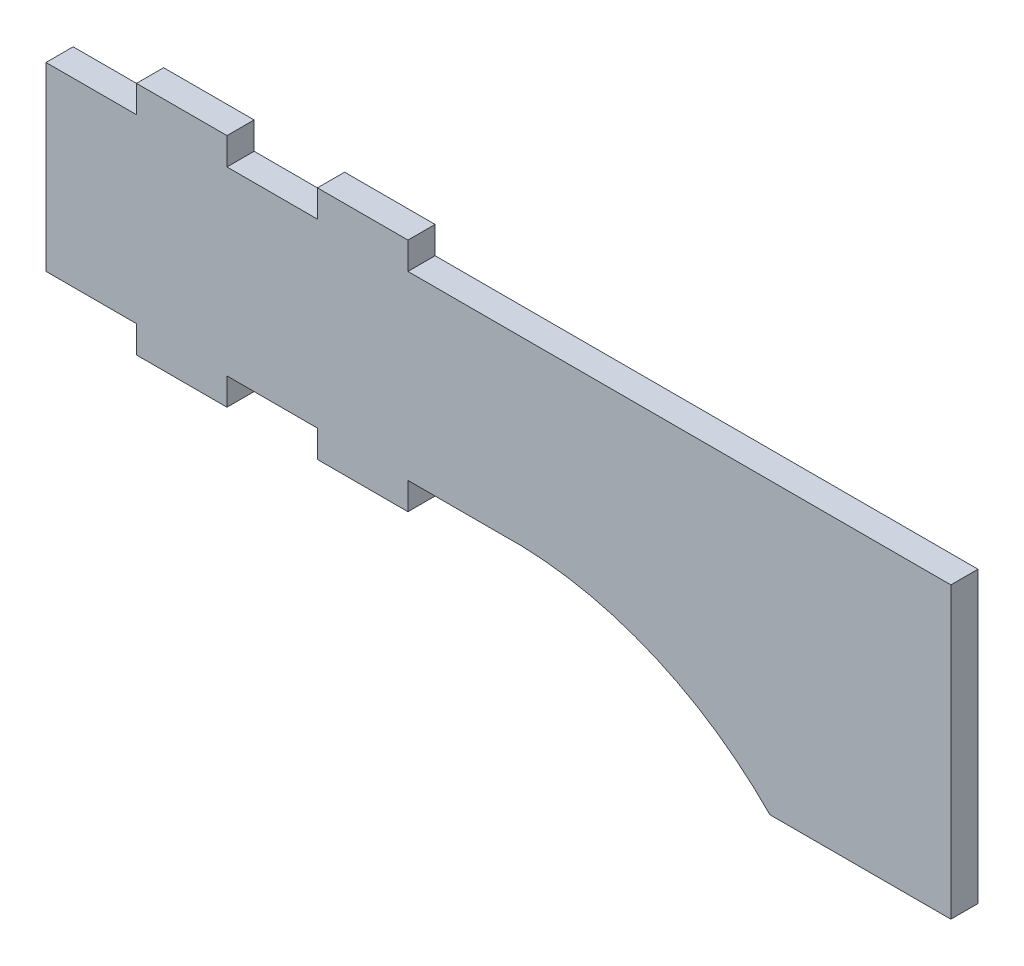
ISO-10303-21;
HEADER;
FILE_DESCRIPTION(('STEP AP214'),'2;1');
FILE_NAME('part.step','',(''),(''),'','','');
FILE_SCHEMA(('AUTOMOTIVE_DESIGN { 1 0 10303 214 1 1 1 1 }'));
ENDSEC;
DATA;
#1=APPLICATION_CONTEXT('core data for automotive mechanical design processes');
#2=APPLICATION_PROTOCOL_DEFINITION('international standard','automotive_design',2000,#1);
#3=PRODUCT_CONTEXT('',#1,'mechanical');
#4=PRODUCT('Part','Part','',(#3));
#5=PRODUCT_RELATED_PRODUCT_CATEGORY('part','',(#4));
#6=PRODUCT_DEFINITION_FORMATION('','',#4);
#7=PRODUCT_DEFINITION_CONTEXT('part definition',#1,'design');
#8=PRODUCT_DEFINITION('design','',#6,#7);
#9=PRODUCT_DEFINITION_SHAPE('','',#8);
#10=(LENGTH_UNIT() NAMED_UNIT(*) SI_UNIT(.MILLI.,.METRE.));
#11=(NAMED_UNIT(*) PLANE_ANGLE_UNIT() SI_UNIT($,.RADIAN.));
#12=(NAMED_UNIT(*) SI_UNIT($,.STERADIAN.) SOLID_ANGLE_UNIT());
#13=UNCERTAINTY_MEASURE_WITH_UNIT(LENGTH_MEASURE(1.E-05),#10,'distance_accuracy_value','');
#14=(GEOMETRIC_REPRESENTATION_CONTEXT(3) GLOBAL_UNCERTAINTY_ASSIGNED_CONTEXT((#13)) GLOBAL_UNIT_ASSIGNED_CONTEXT((#10,
#11,#12)) REPRESENTATION_CONTEXT('',''));
#15=CARTESIAN_POINT('',(0.,0.,0.));
#16=DIRECTION('',(0.,0.,1.));
#17=DIRECTION('',(1.,0.,0.));
#18=AXIS2_PLACEMENT_3D('',#15,#16,#17);
#19=CARTESIAN_POINT('',(-27.5171568507019,-1.37040119863,1.5));
#20=DIRECTION('',(0.,1.,0.));
#21=DIRECTION('',(0.,0.,1.));
#22=AXIS2_PLACEMENT_3D('',#19,#20,#21);
#23=PLANE('',#22);
#24=DIRECTION('',(1.,0.,0.));
#25=VECTOR('',#24,1.);
#26=CARTESIAN_POINT('',(-27.5171568507019,-1.37040119863,0.));
#27=LINE('',#26,#25);
#28=CARTESIAN_POINT('',(-27.5171568507019,-1.37040119863,0.));
#29=VERTEX_POINT('',#28);
#30=CARTESIAN_POINT('',(-22.5171568507019,-1.37040119863,0.));
#31=VERTEX_POINT('',#30);
#32=EDGE_CURVE('E224',#29,#31,#27,.T.);
#33=ORIENTED_EDGE('',*,*,#32,.T.);
#34=DIRECTION('',(0.,0.,-1.));
#35=VECTOR('',#34,1.);
#36=CARTESIAN_POINT('',(-22.5171568507019,-1.37040119863,1.5));
#37=LINE('',#36,#35);
#38=CARTESIAN_POINT('',(-22.5171568507019,-1.37040119863,1.5));
#39=VERTEX_POINT('',#38);
#40=EDGE_CURVE('E11',#39,#31,#37,.T.);
#41=ORIENTED_EDGE('',*,*,#40,.F.);
#42=DIRECTION('',(1.,0.,0.));
#43=VECTOR('',#42,1.);
#44=CARTESIAN_POINT('',(-27.5171568507019,-1.37040119863,1.5));
#45=LINE('',#44,#43);
#46=CARTESIAN_POINT('',(-27.5171568507019,-1.37040119863,1.5));
#47=VERTEX_POINT('',#46);
#48=EDGE_CURVE('E288',#47,#39,#45,.T.);
#49=ORIENTED_EDGE('',*,*,#48,.F.);
#50=DIRECTION('',(0.,0.,-1.));
#51=VECTOR('',#50,1.);
#52=CARTESIAN_POINT('',(-27.5171568507019,-1.37040119863,1.5));
#53=LINE('',#52,#51);
#54=EDGE_CURVE('E220',#47,#29,#53,.T.);
#55=ORIENTED_EDGE('',*,*,#54,.T.);
#56=EDGE_LOOP('',(#33,#41,#49,#55));
#57=FACE_BOUND('',#56,.T.);
#58=ADVANCED_FACE('F39',(#57),#23,.F.);
#59=CARTESIAN_POINT('',(-22.5171568507019,-1.37040119863,1.5));
#60=DIRECTION('',(1.,0.,0.));
#61=DIRECTION('',(0.,0.,-1.));
#62=AXIS2_PLACEMENT_3D('',#59,#60,#61);
#63=PLANE('',#62);
#64=DIRECTION('',(0.,-1.,0.));
#65=VECTOR('',#64,1.);
#66=CARTESIAN_POINT('',(-22.5171568507019,-1.37040119863,0.));
#67=LINE('',#66,#65);
#68=CARTESIAN_POINT('',(-22.5171568507019,-2.87040119863,0.));
#69=VERTEX_POINT('',#68);
#70=EDGE_CURVE('E228',#31,#69,#67,.T.);
#71=ORIENTED_EDGE('',*,*,#70,.T.);
#72=DIRECTION('',(0.,0.,-1.));
#73=VECTOR('',#72,1.);
#74=CARTESIAN_POINT('',(-22.5171568507019,-2.87040119863,1.5));
#75=LINE('',#74,#73);
#76=CARTESIAN_POINT('',(-22.5171568507019,-2.87040119863,1.5));
#77=VERTEX_POINT('',#76);
#78=EDGE_CURVE('E48',#77,#69,#75,.T.);
#79=ORIENTED_EDGE('',*,*,#78,.F.);
#80=DIRECTION('',(0.,-1.,0.));
#81=VECTOR('',#80,1.);
#82=CARTESIAN_POINT('',(-22.5171568507019,-1.37040119863,1.5));
#83=LINE('',#82,#81);
#84=EDGE_CURVE('E141',#39,#77,#83,.T.);
#85=ORIENTED_EDGE('',*,*,#84,.F.);
#86=ORIENTED_EDGE('',*,*,#40,.T.);
#87=EDGE_LOOP('',(#71,#79,#85,#86));
#88=FACE_BOUND('',#87,.T.);
#89=ADVANCED_FACE('F452',(#88),#63,.F.);
#90=CARTESIAN_POINT('',(-22.5171568507019,-2.87040119863,1.5));
#91=DIRECTION('',(0.,1.,0.));
#92=DIRECTION('',(0.,0.,1.));
#93=AXIS2_PLACEMENT_3D('',#90,#91,#92);
#94=PLANE('',#93);
#95=DIRECTION('',(1.,0.,0.));
#96=VECTOR('',#95,1.);
#97=CARTESIAN_POINT('',(-22.5171568507019,-2.87040119863,0.));
#98=LINE('',#97,#96);
#99=CARTESIAN_POINT('',(-17.5171568507019,-2.87040119863,0.));
#100=VERTEX_POINT('',#99);
#101=EDGE_CURVE('E231',#69,#100,#98,.T.);
#102=ORIENTED_EDGE('',*,*,#101,.T.);
#103=DIRECTION('',(0.,0.,-1.));
#104=VECTOR('',#103,1.);
#105=CARTESIAN_POINT('',(-17.5171568507019,-2.87040119863,1.5));
#106=LINE('',#105,#104);
#107=CARTESIAN_POINT('',(-17.5171568507019,-2.87040119863,1.5));
#108=VERTEX_POINT('',#107);
#109=EDGE_CURVE('E355',#108,#100,#106,.T.);
#110=ORIENTED_EDGE('',*,*,#109,.F.);
#111=DIRECTION('',(1.,0.,0.));
#112=VECTOR('',#111,1.);
#113=CARTESIAN_POINT('',(-22.5171568507019,-2.87040119863,1.5));
#114=LINE('',#113,#112);
#115=EDGE_CURVE('E365',#77,#108,#114,.T.);
#116=ORIENTED_EDGE('',*,*,#115,.F.);
#117=ORIENTED_EDGE('',*,*,#78,.T.);
#118=EDGE_LOOP('',(#102,#110,#116,#117));
#119=FACE_BOUND('',#118,.T.);
#120=ADVANCED_FACE('F363',(#119),#94,.F.);
#121=CARTESIAN_POINT('',(-17.5171568507019,-2.87040119863,1.5));
#122=DIRECTION('',(-1.,0.,0.));
#123=DIRECTION('',(0.,0.,1.));
#124=AXIS2_PLACEMENT_3D('',#121,#122,#123);
#125=PLANE('',#124);
#126=DIRECTION('',(0.,1.,0.));
#127=VECTOR('',#126,1.);
#128=CARTESIAN_POINT('',(-17.5171568507019,-2.87040119863,0.));
#129=LINE('',#128,#127);
#130=CARTESIAN_POINT('',(-17.5171568507019,-1.37040119863,0.));
#131=VERTEX_POINT('',#130);
#132=EDGE_CURVE('E234',#100,#131,#129,.T.);
#133=ORIENTED_EDGE('',*,*,#132,.T.);
#134=DIRECTION('',(0.,0.,-1.));
#135=VECTOR('',#134,1.);
#136=CARTESIAN_POINT('',(-17.5171568507019,-1.37040119863,1.5));
#137=LINE('',#136,#135);
#138=CARTESIAN_POINT('',(-17.5171568507019,-1.37040119863,1.5));
#139=VERTEX_POINT('',#138);
#140=EDGE_CURVE('E351',#139,#131,#137,.T.);
#141=ORIENTED_EDGE('',*,*,#140,.F.);
#142=DIRECTION('',(0.,1.,0.));
#143=VECTOR('',#142,1.);
#144=CARTESIAN_POINT('',(-17.5171568507019,-2.87040119863,1.5));
#145=LINE('',#144,#143);
#146=EDGE_CURVE('E384',#108,#139,#145,.T.);
#147=ORIENTED_EDGE('',*,*,#146,.F.);
#148=ORIENTED_EDGE('',*,*,#109,.T.);
#149=EDGE_LOOP('',(#133,#141,#147,#148));
#150=FACE_BOUND('',#149,.T.);
#151=ADVANCED_FACE('F374',(#150),#125,.F.);
#152=CARTESIAN_POINT('',(-17.5171568507019,-1.37040119863,1.5));
#153=DIRECTION('',(0.,1.,0.));
#154=DIRECTION('',(0.,0.,1.));
#155=AXIS2_PLACEMENT_3D('',#152,#153,#154);
#156=PLANE('',#155);
#157=DIRECTION('',(1.,0.,0.));
#158=VECTOR('',#157,1.);
#159=CARTESIAN_POINT('',(-17.5171568507019,-1.37040119863,0.));
#160=LINE('',#159,#158);
#161=CARTESIAN_POINT('',(-12.5171568507019,-1.37040119863,0.));
#162=VERTEX_POINT('',#161);
#163=EDGE_CURVE('E237',#131,#162,#160,.T.);
#164=ORIENTED_EDGE('',*,*,#163,.T.);
#165=DIRECTION('',(0.,0.,-1.));
#166=VECTOR('',#165,1.);
#167=CARTESIAN_POINT('',(-12.5171568507019,-1.37040119863,1.5));
#168=LINE('',#167,#166);
#169=CARTESIAN_POINT('',(-12.5171568507019,-1.37040119863,1.5));
#170=VERTEX_POINT('',#169);
#171=EDGE_CURVE('E347',#170,#162,#168,.T.);
#172=ORIENTED_EDGE('',*,*,#171,.F.);
#173=DIRECTION('',(1.,0.,0.));
#174=VECTOR('',#173,1.);
#175=CARTESIAN_POINT('',(-17.5171568507019,-1.37040119863,1.5));
#176=LINE('',#175,#174);
#177=EDGE_CURVE('E380',#139,#170,#176,.T.);
#178=ORIENTED_EDGE('',*,*,#177,.F.);
#179=ORIENTED_EDGE('',*,*,#140,.T.);
#180=EDGE_LOOP('',(#164,#172,#178,#179));
#181=FACE_BOUND('',#180,.T.);
#182=ADVANCED_FACE('F378',(#181),#156,.F.);
#183=CARTESIAN_POINT('',(-12.5171568507019,-1.37040119863,1.5));
#184=DIRECTION('',(1.,0.,0.));
#185=DIRECTION('',(0.,0.,-1.));
#186=AXIS2_PLACEMENT_3D('',#183,#184,#185);
#187=PLANE('',#186);
#188=DIRECTION('',(0.,-1.,0.));
#189=VECTOR('',#188,1.);
#190=CARTESIAN_POINT('',(-12.5171568507019,-1.37040119863,0.));
#191=LINE('',#190,#189);
#192=CARTESIAN_POINT('',(-12.5171568507019,-2.87040119863,0.));
#193=VERTEX_POINT('',#192);
#194=EDGE_CURVE('E240',#162,#193,#191,.T.);
#195=ORIENTED_EDGE('',*,*,#194,.T.);
#196=DIRECTION('',(0.,0.,-1.));
#197=VECTOR('',#196,1.);
#198=CARTESIAN_POINT('',(-12.5171568507019,-2.87040119863,1.5));
#199=LINE('',#198,#197);
#200=CARTESIAN_POINT('',(-12.5171568507019,-2.87040119863,1.5));
#201=VERTEX_POINT('',#200);
#202=EDGE_CURVE('E343',#201,#193,#199,.T.);
#203=ORIENTED_EDGE('',*,*,#202,.F.);
#204=DIRECTION('',(0.,-1.,0.));
#205=VECTOR('',#204,1.);
#206=CARTESIAN_POINT('',(-12.5171568507019,-1.37040119863,1.5));
#207=LINE('',#206,#205);
#208=EDGE_CURVE('E383',#170,#201,#207,.T.);
#209=ORIENTED_EDGE('',*,*,#208,.F.);
#210=ORIENTED_EDGE('',*,*,#171,.T.);
#211=EDGE_LOOP('',(#195,#203,#209,#210));
#212=FACE_BOUND('',#211,.T.);
#213=ADVANCED_FACE('F465',(#212),#187,.F.);
#214=CARTESIAN_POINT('',(-12.5171568507019,-2.87040119863,1.5));
#215=DIRECTION('',(0.,1.,0.));
#216=DIRECTION('',(0.,0.,1.));
#217=AXIS2_PLACEMENT_3D('',#214,#215,#216);
#218=PLANE('',#217);
#219=DIRECTION('',(1.,0.,0.));
#220=VECTOR('',#219,1.);
#221=CARTESIAN_POINT('',(-12.5171568507019,-2.87040119863,0.));
#222=LINE('',#221,#220);
#223=CARTESIAN_POINT('',(-7.5171568507019,-2.87040119863,0.));
#224=VERTEX_POINT('',#223);
#225=EDGE_CURVE('E243',#193,#224,#222,.T.);
#226=ORIENTED_EDGE('',*,*,#225,.T.);
#227=DIRECTION('',(0.,0.,-1.));
#228=VECTOR('',#227,1.);
#229=CARTESIAN_POINT('',(-7.5171568507019,-2.87040119863,1.5));
#230=LINE('',#229,#228);
#231=CARTESIAN_POINT('',(-7.5171568507019,-2.87040119863,1.5));
#232=VERTEX_POINT('',#231);
#233=EDGE_CURVE('E339',#232,#224,#230,.T.);
#234=ORIENTED_EDGE('',*,*,#233,.F.);
#235=DIRECTION('',(1.,0.,0.));
#236=VECTOR('',#235,1.);
#237=CARTESIAN_POINT('',(-12.5171568507019,-2.87040119863,1.5));
#238=LINE('',#237,#236);
#239=EDGE_CURVE('E388',#201,#232,#238,.T.);
#240=ORIENTED_EDGE('',*,*,#239,.F.);
#241=ORIENTED_EDGE('',*,*,#202,.T.);
#242=EDGE_LOOP('',(#226,#234,#240,#241));
#243=FACE_BOUND('',#242,.T.);
#244=ADVANCED_FACE('F468',(#243),#218,.F.);
#245=CARTESIAN_POINT('',(-7.5171568507019,-2.87040119863,1.5));
#246=DIRECTION('',(-1.,0.,0.));
#247=DIRECTION('',(0.,0.,1.));
#248=AXIS2_PLACEMENT_3D('',#245,#246,#247);
#249=PLANE('',#248);
#250=DIRECTION('',(0.,1.,0.));
#251=VECTOR('',#250,1.);
#252=CARTESIAN_POINT('',(-7.5171568507019,-2.87040119863,0.));
#253=LINE('',#252,#251);
#254=CARTESIAN_POINT('',(-7.5171568507019,-1.37040119863,0.));
#255=VERTEX_POINT('',#254);
#256=EDGE_CURVE('E246',#224,#255,#253,.T.);
#257=ORIENTED_EDGE('',*,*,#256,.T.);
#258=DIRECTION('',(0.,0.,-1.));
#259=VECTOR('',#258,1.);
#260=CARTESIAN_POINT('',(-7.5171568507019,-1.37040119863,1.5));
#261=LINE('',#260,#259);
#262=CARTESIAN_POINT('',(-7.5171568507019,-1.37040119863,1.5));
#263=VERTEX_POINT('',#262);
#264=EDGE_CURVE('E335',#263,#255,#261,.T.);
#265=ORIENTED_EDGE('',*,*,#264,.F.);
#266=DIRECTION('',(0.,1.,0.));
#267=VECTOR('',#266,1.);
#268=CARTESIAN_POINT('',(-7.5171568507019,-2.87040119863,1.5));
#269=LINE('',#268,#267);
#270=EDGE_CURVE('E395',#232,#263,#269,.T.);
#271=ORIENTED_EDGE('',*,*,#270,.F.);
#272=ORIENTED_EDGE('',*,*,#233,.T.);
#273=EDGE_LOOP('',(#257,#265,#271,#272));
#274=FACE_BOUND('',#273,.T.);
#275=ADVANCED_FACE('F472',(#274),#249,.F.);
#276=CARTESIAN_POINT('',(-7.5171568507019,-1.37040119863,1.5));
#277=DIRECTION('',(0.,1.,0.));
#278=DIRECTION('',(0.,0.,1.));
#279=AXIS2_PLACEMENT_3D('',#276,#277,#278);
#280=PLANE('',#279);
#281=DIRECTION('',(1.,0.,0.));
#282=VECTOR('',#281,1.);
#283=CARTESIAN_POINT('',(-7.5171568507019,-1.37040119863,0.));
#284=LINE('',#283,#282);
#285=CARTESIAN_POINT('',(-2.5171568507019,-1.37040119862999,0.));
#286=VERTEX_POINT('',#285);
#287=EDGE_CURVE('E249',#255,#286,#284,.T.);
#288=ORIENTED_EDGE('',*,*,#287,.T.);
#289=DIRECTION('',(0.,0.,-1.));
#290=VECTOR('',#289,1.);
#291=CARTESIAN_POINT('',(-2.5171568507019,-1.37040119862999,1.5));
#292=LINE('',#291,#290);
#293=CARTESIAN_POINT('',(-2.5171568507019,-1.37040119862999,1.5));
#294=VERTEX_POINT('',#293);
#295=EDGE_CURVE('E331',#294,#286,#292,.T.);
#296=ORIENTED_EDGE('',*,*,#295,.F.);
#297=DIRECTION('',(1.,0.,0.));
#298=VECTOR('',#297,1.);
#299=CARTESIAN_POINT('',(-7.5171568507019,-1.37040119863,1.5));
#300=LINE('',#299,#298);
#301=EDGE_CURVE('E398',#263,#294,#300,.T.);
#302=ORIENTED_EDGE('',*,*,#301,.F.);
#303=ORIENTED_EDGE('',*,*,#264,.T.);
#304=EDGE_LOOP('',(#288,#296,#302,#303));
#305=FACE_BOUND('',#304,.T.);
#306=ADVANCED_FACE('F476',(#305),#280,.F.);
#307=CARTESIAN_POINT('',(-1.81218545940572,-21.3579727203896,1.5));
#308=DIRECTION('',(0.,0.,-1.));
#309=DIRECTION('',(-1.,0.,0.));
#310=AXIS2_PLACEMENT_3D('',#307,#308,#309);
#311=CYLINDRICAL_SURFACE('',#310,20.);
#312=CARTESIAN_POINT('',(-1.81218545940572,-21.3579727203896,0.));
#313=DIRECTION('',(0.,0.,-1.));
#314=DIRECTION('',(-1.,0.,0.));
#315=AXIS2_PLACEMENT_3D('',#312,#313,#314);
#316=CIRCLE('',#315,20.);
#317=CARTESIAN_POINT('',(12.4828431492981,-7.37040119863,0.));
#318=VERTEX_POINT('',#317);
#319=EDGE_CURVE('E252',#286,#318,#316,.T.);
#320=ORIENTED_EDGE('',*,*,#319,.T.);
#321=DIRECTION('',(0.,0.,-1.));
#322=VECTOR('',#321,1.);
#323=CARTESIAN_POINT('',(12.4828431492981,-7.37040119863,1.5));
#324=LINE('',#323,#322);
#325=CARTESIAN_POINT('',(12.4828431492981,-7.37040119863,1.5));
#326=VERTEX_POINT('',#325);
#327=EDGE_CURVE('E327',#326,#318,#324,.T.);
#328=ORIENTED_EDGE('',*,*,#327,.F.);
#329=CARTESIAN_POINT('',(-1.81218545940572,-21.3579727203896,1.5));
#330=DIRECTION('',(0.,0.,-1.));
#331=DIRECTION('',(-1.,0.,0.));
#332=AXIS2_PLACEMENT_3D('',#329,#330,#331);
#333=CIRCLE('',#332,20.);
#334=EDGE_CURVE('E401',#294,#326,#333,.T.);
#335=ORIENTED_EDGE('',*,*,#334,.F.);
#336=ORIENTED_EDGE('',*,*,#295,.T.);
#337=EDGE_LOOP('',(#320,#328,#335,#336));
#338=FACE_BOUND('',#337,.T.);
#339=ADVANCED_FACE('F480',(#338),#311,.F.);
#340=CARTESIAN_POINT('',(22.4828431492981,-7.37040119863,1.5));
#341=DIRECTION('',(0.,1.,0.));
#342=DIRECTION('',(-1.,0.,0.));
#343=AXIS2_PLACEMENT_3D('',#340,#341,#342);
#344=PLANE('',#343);
#345=DIRECTION('',(1.,0.,0.));
#346=VECTOR('',#345,1.);
#347=CARTESIAN_POINT('',(22.4828431492981,-7.37040119863,0.));
#348=LINE('',#347,#346);
#349=CARTESIAN_POINT('',(22.4828431492981,-7.37040119863,0.));
#350=VERTEX_POINT('',#349);
#351=EDGE_CURVE('E255',#318,#350,#348,.T.);
#352=ORIENTED_EDGE('',*,*,#351,.T.);
#353=DIRECTION('',(0.,0.,-1.));
#354=VECTOR('',#353,1.);
#355=CARTESIAN_POINT('',(22.4828431492981,-7.37040119863,1.5));
#356=LINE('',#355,#354);
#357=CARTESIAN_POINT('',(22.4828431492981,-7.37040119863,1.5));
#358=VERTEX_POINT('',#357);
#359=EDGE_CURVE('E323',#358,#350,#356,.T.);
#360=ORIENTED_EDGE('',*,*,#359,.F.);
#361=DIRECTION('',(1.,0.,0.));
#362=VECTOR('',#361,1.);
#363=CARTESIAN_POINT('',(22.4828431492981,-7.37040119863,1.5));
#364=LINE('',#363,#362);
#365=EDGE_CURVE('E404',#326,#358,#364,.T.);
#366=ORIENTED_EDGE('',*,*,#365,.F.);
#367=ORIENTED_EDGE('',*,*,#327,.T.);
#368=EDGE_LOOP('',(#352,#360,#366,#367));
#369=FACE_BOUND('',#368,.T.);
#370=ADVANCED_FACE('F484',(#369),#344,.F.);
#371=CARTESIAN_POINT('',(22.4828431492981,8.62959880137,1.5));
#372=DIRECTION('',(-1.,0.,0.));
#373=DIRECTION('',(0.,-1.,0.));
#374=AXIS2_PLACEMENT_3D('',#371,#372,#373);
#375=PLANE('',#374);
#376=DIRECTION('',(0.,1.,0.));
#377=VECTOR('',#376,1.);
#378=CARTESIAN_POINT('',(22.4828431492981,8.62959880137,0.));
#379=LINE('',#378,#377);
#380=CARTESIAN_POINT('',(22.4828431492981,8.62959880137,0.));
#381=VERTEX_POINT('',#380);
#382=EDGE_CURVE('E258',#350,#381,#379,.T.);
#383=ORIENTED_EDGE('',*,*,#382,.T.);
#384=DIRECTION('',(0.,0.,-1.));
#385=VECTOR('',#384,1.);
#386=CARTESIAN_POINT('',(22.4828431492981,8.62959880137,1.5));
#387=LINE('',#386,#385);
#388=CARTESIAN_POINT('',(22.4828431492981,8.62959880137,1.5));
#389=VERTEX_POINT('',#388);
#390=EDGE_CURVE('E319',#389,#381,#387,.T.);
#391=ORIENTED_EDGE('',*,*,#390,.F.);
#392=DIRECTION('',(0.,1.,0.));
#393=VECTOR('',#392,1.);
#394=CARTESIAN_POINT('',(22.4828431492981,8.62959880137,1.5));
#395=LINE('',#394,#393);
#396=EDGE_CURVE('E407',#358,#389,#395,.T.);
#397=ORIENTED_EDGE('',*,*,#396,.F.);
#398=ORIENTED_EDGE('',*,*,#359,.T.);
#399=EDGE_LOOP('',(#383,#391,#397,#398));
#400=FACE_BOUND('',#399,.T.);
#401=ADVANCED_FACE('F488',(#400),#375,.F.);
#402=CARTESIAN_POINT('',(-7.5171568507019,8.62959880137,1.5));
#403=DIRECTION('',(0.,-1.,0.));
#404=DIRECTION('',(0.,0.,-1.));
#405=AXIS2_PLACEMENT_3D('',#402,#403,#404);
#406=PLANE('',#405);
#407=DIRECTION('',(-1.,0.,0.));
#408=VECTOR('',#407,1.);
#409=CARTESIAN_POINT('',(-7.5171568507019,8.62959880137,0.));
#410=LINE('',#409,#408);
#411=CARTESIAN_POINT('',(-7.5171568507019,8.62959880137,0.));
#412=VERTEX_POINT('',#411);
#413=EDGE_CURVE('E261',#381,#412,#410,.T.);
#414=ORIENTED_EDGE('',*,*,#413,.T.);
#415=DIRECTION('',(0.,0.,-1.));
#416=VECTOR('',#415,1.);
#417=CARTESIAN_POINT('',(-7.5171568507019,8.62959880137,1.5));
#418=LINE('',#417,#416);
#419=CARTESIAN_POINT('',(-7.5171568507019,8.62959880137,1.5));
#420=VERTEX_POINT('',#419);
#421=EDGE_CURVE('E315',#420,#412,#418,.T.);
#422=ORIENTED_EDGE('',*,*,#421,.F.);
#423=DIRECTION('',(-1.,0.,0.));
#424=VECTOR('',#423,1.);
#425=CARTESIAN_POINT('',(-7.5171568507019,8.62959880137,1.5));
#426=LINE('',#425,#424);
#427=EDGE_CURVE('E410',#389,#420,#426,.T.);
#428=ORIENTED_EDGE('',*,*,#427,.F.);
#429=ORIENTED_EDGE('',*,*,#390,.T.);
#430=EDGE_LOOP('',(#414,#422,#428,#429));
#431=FACE_BOUND('',#430,.T.);
#432=ADVANCED_FACE('F492',(#431),#406,.F.);
#433=CARTESIAN_POINT('',(-7.51715685070194,10.12959880137,1.5));
#434=DIRECTION('',(-1.,0.,0.));
#435=DIRECTION('',(0.,-1.,0.));
#436=AXIS2_PLACEMENT_3D('',#433,#434,#435);
#437=PLANE('',#436);
#438=DIRECTION('',(0.,1.,0.));
#439=VECTOR('',#438,1.);
#440=CARTESIAN_POINT('',(-7.51715685070194,10.12959880137,0.));
#441=LINE('',#440,#439);
#442=CARTESIAN_POINT('',(-7.51715685070194,10.12959880137,0.));
#443=VERTEX_POINT('',#442);
#444=EDGE_CURVE('E264',#412,#443,#441,.T.);
#445=ORIENTED_EDGE('',*,*,#444,.T.);
#446=DIRECTION('',(0.,0.,-1.));
#447=VECTOR('',#446,1.);
#448=CARTESIAN_POINT('',(-7.51715685070194,10.12959880137,1.5));
#449=LINE('',#448,#447);
#450=CARTESIAN_POINT('',(-7.51715685070194,10.12959880137,1.5));
#451=VERTEX_POINT('',#450);
#452=EDGE_CURVE('E311',#451,#443,#449,.T.);
#453=ORIENTED_EDGE('',*,*,#452,.F.);
#454=DIRECTION('',(0.,1.,0.));
#455=VECTOR('',#454,1.);
#456=CARTESIAN_POINT('',(-7.51715685070194,10.12959880137,1.5));
#457=LINE('',#456,#455);
#458=EDGE_CURVE('E413',#420,#451,#457,.T.);
#459=ORIENTED_EDGE('',*,*,#458,.F.);
#460=ORIENTED_EDGE('',*,*,#421,.T.);
#461=EDGE_LOOP('',(#445,#453,#459,#460));
#462=FACE_BOUND('',#461,.T.);
#463=ADVANCED_FACE('F496',(#462),#437,.F.);
#464=CARTESIAN_POINT('',(-12.5171568507019,10.12959880137,1.5));
#465=DIRECTION('',(0.,-1.,0.));
#466=DIRECTION('',(0.,0.,-1.));
#467=AXIS2_PLACEMENT_3D('',#464,#465,#466);
#468=PLANE('',#467);
#469=DIRECTION('',(-1.,0.,0.));
#470=VECTOR('',#469,1.);
#471=CARTESIAN_POINT('',(-12.5171568507019,10.12959880137,0.));
#472=LINE('',#471,#470);
#473=CARTESIAN_POINT('',(-12.5171568507019,10.12959880137,0.));
#474=VERTEX_POINT('',#473);
#475=EDGE_CURVE('E267',#443,#474,#472,.T.);
#476=ORIENTED_EDGE('',*,*,#475,.T.);
#477=DIRECTION('',(0.,0.,-1.));
#478=VECTOR('',#477,1.);
#479=CARTESIAN_POINT('',(-12.5171568507019,10.12959880137,1.5));
#480=LINE('',#479,#478);
#481=CARTESIAN_POINT('',(-12.5171568507019,10.12959880137,1.5));
#482=VERTEX_POINT('',#481);
#483=EDGE_CURVE('E307',#482,#474,#480,.T.);
#484=ORIENTED_EDGE('',*,*,#483,.F.);
#485=DIRECTION('',(-1.,0.,0.));
#486=VECTOR('',#485,1.);
#487=CARTESIAN_POINT('',(-12.5171568507019,10.12959880137,1.5));
#488=LINE('',#487,#486);
#489=EDGE_CURVE('E416',#451,#482,#488,.T.);
#490=ORIENTED_EDGE('',*,*,#489,.F.);
#491=ORIENTED_EDGE('',*,*,#452,.T.);
#492=EDGE_LOOP('',(#476,#484,#490,#491));
#493=FACE_BOUND('',#492,.T.);
#494=ADVANCED_FACE('F500',(#493),#468,.F.);
#495=CARTESIAN_POINT('',(-12.5171568507019,8.62959880137,1.5));
#496=DIRECTION('',(1.,0.,0.));
#497=DIRECTION('',(0.,0.,-1.));
#498=AXIS2_PLACEMENT_3D('',#495,#496,#497);
#499=PLANE('',#498);
#500=DIRECTION('',(0.,-1.,0.));
#501=VECTOR('',#500,1.);
#502=CARTESIAN_POINT('',(-12.5171568507019,8.62959880137,0.));
#503=LINE('',#502,#501);
#504=CARTESIAN_POINT('',(-12.5171568507019,8.62959880137,0.));
#505=VERTEX_POINT('',#504);
#506=EDGE_CURVE('E270',#474,#505,#503,.T.);
#507=ORIENTED_EDGE('',*,*,#506,.T.);
#508=DIRECTION('',(0.,0.,-1.));
#509=VECTOR('',#508,1.);
#510=CARTESIAN_POINT('',(-12.5171568507019,8.62959880137,1.5));
#511=LINE('',#510,#509);
#512=CARTESIAN_POINT('',(-12.5171568507019,8.62959880137,1.5));
#513=VERTEX_POINT('',#512);
#514=EDGE_CURVE('E303',#513,#505,#511,.T.);
#515=ORIENTED_EDGE('',*,*,#514,.F.);
#516=DIRECTION('',(0.,-1.,0.));
#517=VECTOR('',#516,1.);
#518=CARTESIAN_POINT('',(-12.5171568507019,8.62959880137,1.5));
#519=LINE('',#518,#517);
#520=EDGE_CURVE('E419',#482,#513,#519,.T.);
#521=ORIENTED_EDGE('',*,*,#520,.F.);
#522=ORIENTED_EDGE('',*,*,#483,.T.);
#523=EDGE_LOOP('',(#507,#515,#521,#522));
#524=FACE_BOUND('',#523,.T.);
#525=ADVANCED_FACE('F504',(#524),#499,.F.);
#526=CARTESIAN_POINT('',(-17.5171568507019,8.62959880137,1.5));
#527=DIRECTION('',(0.,-1.,0.));
#528=DIRECTION('',(0.,0.,-1.));
#529=AXIS2_PLACEMENT_3D('',#526,#527,#528);
#530=PLANE('',#529);
#531=DIRECTION('',(-1.,0.,0.));
#532=VECTOR('',#531,1.);
#533=CARTESIAN_POINT('',(-17.5171568507019,8.62959880137,0.));
#534=LINE('',#533,#532);
#535=CARTESIAN_POINT('',(-17.5171568507019,8.62959880137,0.));
#536=VERTEX_POINT('',#535);
#537=EDGE_CURVE('E273',#505,#536,#534,.T.);
#538=ORIENTED_EDGE('',*,*,#537,.T.);
#539=DIRECTION('',(0.,0.,-1.));
#540=VECTOR('',#539,1.);
#541=CARTESIAN_POINT('',(-17.5171568507019,8.62959880137,1.5));
#542=LINE('',#541,#540);
#543=CARTESIAN_POINT('',(-17.5171568507019,8.62959880137,1.5));
#544=VERTEX_POINT('',#543);
#545=EDGE_CURVE('E299',#544,#536,#542,.T.);
#546=ORIENTED_EDGE('',*,*,#545,.F.);
#547=DIRECTION('',(-1.,0.,0.));
#548=VECTOR('',#547,1.);
#549=CARTESIAN_POINT('',(-17.5171568507019,8.62959880137,1.5));
#550=LINE('',#549,#548);
#551=EDGE_CURVE('E422',#513,#544,#550,.T.);
#552=ORIENTED_EDGE('',*,*,#551,.F.);
#553=ORIENTED_EDGE('',*,*,#514,.T.);
#554=EDGE_LOOP('',(#538,#546,#552,#553));
#555=FACE_BOUND('',#554,.T.);
#556=ADVANCED_FACE('F508',(#555),#530,.F.);
#557=CARTESIAN_POINT('',(-17.5171568507019,10.12959880137,1.5));
#558=DIRECTION('',(-1.,0.,0.));
#559=DIRECTION('',(0.,-1.,0.));
#560=AXIS2_PLACEMENT_3D('',#557,#558,#559);
#561=PLANE('',#560);
#562=DIRECTION('',(0.,1.,0.));
#563=VECTOR('',#562,1.);
#564=CARTESIAN_POINT('',(-17.5171568507019,10.12959880137,0.));
#565=LINE('',#564,#563);
#566=CARTESIAN_POINT('',(-17.5171568507019,10.12959880137,0.));
#567=VERTEX_POINT('',#566);
#568=EDGE_CURVE('E276',#536,#567,#565,.T.);
#569=ORIENTED_EDGE('',*,*,#568,.T.);
#570=DIRECTION('',(0.,0.,-1.));
#571=VECTOR('',#570,1.);
#572=CARTESIAN_POINT('',(-17.5171568507019,10.12959880137,1.5));
#573=LINE('',#572,#571);
#574=CARTESIAN_POINT('',(-17.5171568507019,10.12959880137,1.5));
#575=VERTEX_POINT('',#574);
#576=EDGE_CURVE('E295',#575,#567,#573,.T.);
#577=ORIENTED_EDGE('',*,*,#576,.F.);
#578=DIRECTION('',(0.,1.,0.));
#579=VECTOR('',#578,1.);
#580=CARTESIAN_POINT('',(-17.5171568507019,10.12959880137,1.5));
#581=LINE('',#580,#579);
#582=EDGE_CURVE('E425',#544,#575,#581,.T.);
#583=ORIENTED_EDGE('',*,*,#582,.F.);
#584=ORIENTED_EDGE('',*,*,#545,.T.);
#585=EDGE_LOOP('',(#569,#577,#583,#584));
#586=FACE_BOUND('',#585,.T.);
#587=ADVANCED_FACE('F433',(#586),#561,.F.);
#588=CARTESIAN_POINT('',(-22.5171568507019,10.12959880137,1.5));
#589=DIRECTION('',(0.,-1.,0.));
#590=DIRECTION('',(0.,0.,-1.));
#591=AXIS2_PLACEMENT_3D('',#588,#589,#590);
#592=PLANE('',#591);
#593=DIRECTION('',(-1.,0.,0.));
#594=VECTOR('',#593,1.);
#595=CARTESIAN_POINT('',(-22.5171568507019,10.12959880137,0.));
#596=LINE('',#595,#594);
#597=CARTESIAN_POINT('',(-22.5171568507019,10.12959880137,0.));
#598=VERTEX_POINT('',#597);
#599=EDGE_CURVE('E279',#567,#598,#596,.T.);
#600=ORIENTED_EDGE('',*,*,#599,.T.);
#601=DIRECTION('',(0.,0.,-1.));
#602=VECTOR('',#601,1.);
#603=CARTESIAN_POINT('',(-22.5171568507019,10.12959880137,1.5));
#604=LINE('',#603,#602);
#605=CARTESIAN_POINT('',(-22.5171568507019,10.12959880137,1.5));
#606=VERTEX_POINT('',#605);
#607=EDGE_CURVE('E213',#606,#598,#604,.T.);
#608=ORIENTED_EDGE('',*,*,#607,.F.);
#609=DIRECTION('',(-1.,0.,0.));
#610=VECTOR('',#609,1.);
#611=CARTESIAN_POINT('',(-22.5171568507019,10.12959880137,1.5));
#612=LINE('',#611,#610);
#613=EDGE_CURVE('E202',#575,#606,#612,.T.);
#614=ORIENTED_EDGE('',*,*,#613,.F.);
#615=ORIENTED_EDGE('',*,*,#576,.T.);
#616=EDGE_LOOP('',(#600,#608,#614,#615));
#617=FACE_BOUND('',#616,.T.);
#618=ADVANCED_FACE('F437',(#617),#592,.F.);
#619=CARTESIAN_POINT('',(-22.5171568507019,8.62959880137,1.5));
#620=DIRECTION('',(1.,0.,0.));
#621=DIRECTION('',(0.,0.,-1.));
#622=AXIS2_PLACEMENT_3D('',#619,#620,#621);
#623=PLANE('',#622);
#624=DIRECTION('',(0.,-1.,0.));
#625=VECTOR('',#624,1.);
#626=CARTESIAN_POINT('',(-22.5171568507019,8.62959880137,0.));
#627=LINE('',#626,#625);
#628=CARTESIAN_POINT('',(-22.5171568507019,8.62959880137,0.));
#629=VERTEX_POINT('',#628);
#630=EDGE_CURVE('E211',#598,#629,#627,.T.);
#631=ORIENTED_EDGE('',*,*,#630,.T.);
#632=DIRECTION('',(0.,0.,-1.));
#633=VECTOR('',#632,1.);
#634=CARTESIAN_POINT('',(-22.5171568507019,8.62959880137,1.5));
#635=LINE('',#634,#633);
#636=CARTESIAN_POINT('',(-22.5171568507019,8.62959880137,1.5));
#637=VERTEX_POINT('',#636);
#638=EDGE_CURVE('E208',#637,#629,#635,.T.);
#639=ORIENTED_EDGE('',*,*,#638,.F.);
#640=DIRECTION('',(0.,-1.,0.));
#641=VECTOR('',#640,1.);
#642=CARTESIAN_POINT('',(-22.5171568507019,8.62959880137,1.5));
#643=LINE('',#642,#641);
#644=EDGE_CURVE('E196',#606,#637,#643,.T.);
#645=ORIENTED_EDGE('',*,*,#644,.F.);
#646=ORIENTED_EDGE('',*,*,#607,.T.);
#647=EDGE_LOOP('',(#631,#639,#645,#646));
#648=FACE_BOUND('',#647,.T.);
#649=ADVANCED_FACE('F209',(#648),#623,.F.);
#650=CARTESIAN_POINT('',(-27.5171568507019,8.62959880137,1.5));
#651=DIRECTION('',(0.,-1.,0.));
#652=DIRECTION('',(0.,0.,-1.));
#653=AXIS2_PLACEMENT_3D('',#650,#651,#652);
#654=PLANE('',#653);
#655=DIRECTION('',(-1.,0.,0.));
#656=VECTOR('',#655,1.);
#657=CARTESIAN_POINT('',(-27.5171568507019,8.62959880137,0.));
#658=LINE('',#657,#656);
#659=CARTESIAN_POINT('',(-27.5171568507019,8.62959880137,0.));
#660=VERTEX_POINT('',#659);
#661=EDGE_CURVE('E127',#629,#660,#658,.T.);
#662=ORIENTED_EDGE('',*,*,#661,.T.);
#663=DIRECTION('',(0.,0.,-1.));
#664=VECTOR('',#663,1.);
#665=CARTESIAN_POINT('',(-27.5171568507019,8.62959880137,1.5));
#666=LINE('',#665,#664);
#667=CARTESIAN_POINT('',(-27.5171568507019,8.62959880137,1.5));
#668=VERTEX_POINT('',#667);
#669=EDGE_CURVE('E214',#668,#660,#666,.T.);
#670=ORIENTED_EDGE('',*,*,#669,.F.);
#671=DIRECTION('',(-1.,0.,0.));
#672=VECTOR('',#671,1.);
#673=CARTESIAN_POINT('',(-27.5171568507019,8.62959880137,1.5));
#674=LINE('',#673,#672);
#675=EDGE_CURVE('E200',#637,#668,#674,.T.);
#676=ORIENTED_EDGE('',*,*,#675,.F.);
#677=ORIENTED_EDGE('',*,*,#638,.T.);
#678=EDGE_LOOP('',(#662,#670,#676,#677));
#679=FACE_BOUND('',#678,.T.);
#680=ADVANCED_FACE('F216',(#679),#654,.F.);
#681=CARTESIAN_POINT('',(-27.5171568507019,-1.37040119863,1.5));
#682=DIRECTION('',(1.,0.,0.));
#683=DIRECTION('',(0.,0.,-1.));
#684=AXIS2_PLACEMENT_3D('',#681,#682,#683);
#685=PLANE('',#684);
#686=DIRECTION('',(0.,-1.,0.));
#687=VECTOR('',#686,1.);
#688=CARTESIAN_POINT('',(-27.5171568507019,-1.37040119863,0.));
#689=LINE('',#688,#687);
#690=EDGE_CURVE('E133',#660,#29,#689,.T.);
#691=ORIENTED_EDGE('',*,*,#690,.T.);
#692=ORIENTED_EDGE('',*,*,#54,.F.);
#693=DIRECTION('',(0.,-1.,0.));
#694=VECTOR('',#693,1.);
#695=CARTESIAN_POINT('',(-27.5171568507019,-1.37040119863,1.5));
#696=LINE('',#695,#694);
#697=EDGE_CURVE('E56',#668,#47,#696,.T.);
#698=ORIENTED_EDGE('',*,*,#697,.F.);
#699=ORIENTED_EDGE('',*,*,#669,.T.);
#700=EDGE_LOOP('',(#691,#692,#698,#699));
#701=FACE_BOUND('',#700,.T.);
#702=ADVANCED_FACE('F441',(#701),#685,.F.);
#703=CARTESIAN_POINT('',(-1.81218545940572,-21.3579727203896,1.5));
#704=DIRECTION('',(0.,0.,-1.));
#705=DIRECTION('',(-1.,0.,0.));
#706=AXIS2_PLACEMENT_3D('',#703,#704,#705);
#707=PLANE('',#706);
#708=ORIENTED_EDGE('',*,*,#48,.T.);
#709=ORIENTED_EDGE('',*,*,#84,.T.);
#710=ORIENTED_EDGE('',*,*,#115,.T.);
#711=ORIENTED_EDGE('',*,*,#146,.T.);
#712=ORIENTED_EDGE('',*,*,#177,.T.);
#713=ORIENTED_EDGE('',*,*,#208,.T.);
#714=ORIENTED_EDGE('',*,*,#239,.T.);
#715=ORIENTED_EDGE('',*,*,#270,.T.);
#716=ORIENTED_EDGE('',*,*,#301,.T.);
#717=ORIENTED_EDGE('',*,*,#334,.T.);
#718=ORIENTED_EDGE('',*,*,#365,.T.);
#719=ORIENTED_EDGE('',*,*,#396,.T.);
#720=ORIENTED_EDGE('',*,*,#427,.T.);
#721=ORIENTED_EDGE('',*,*,#458,.T.);
#722=ORIENTED_EDGE('',*,*,#489,.T.);
#723=ORIENTED_EDGE('',*,*,#520,.T.);
#724=ORIENTED_EDGE('',*,*,#551,.T.);
#725=ORIENTED_EDGE('',*,*,#582,.T.);
#726=ORIENTED_EDGE('',*,*,#613,.T.);
#727=ORIENTED_EDGE('',*,*,#644,.T.);
#728=ORIENTED_EDGE('',*,*,#675,.T.);
#729=ORIENTED_EDGE('',*,*,#697,.T.);
#730=EDGE_LOOP('',(#708,#709,#710,#711,#712,#713,#714,#715,#716,#717,#718,#719,#720,#721,#722,
#723,#724,#725,#726,#727,#728,#729));
#731=FACE_BOUND('',#730,.T.);
#732=ADVANCED_FACE('F198',(#731),#707,.F.);
#733=CARTESIAN_POINT('',(-1.81218545940572,-21.3579727203896,0.));
#734=DIRECTION('',(0.,0.,-1.));
#735=DIRECTION('',(-1.,0.,0.));
#736=AXIS2_PLACEMENT_3D('',#733,#734,#735);
#737=PLANE('',#736);
#738=ORIENTED_EDGE('',*,*,#32,.F.);
#739=ORIENTED_EDGE('',*,*,#690,.F.);
#740=ORIENTED_EDGE('',*,*,#661,.F.);
#741=ORIENTED_EDGE('',*,*,#630,.F.);
#742=ORIENTED_EDGE('',*,*,#599,.F.);
#743=ORIENTED_EDGE('',*,*,#568,.F.);
#744=ORIENTED_EDGE('',*,*,#537,.F.);
#745=ORIENTED_EDGE('',*,*,#506,.F.);
#746=ORIENTED_EDGE('',*,*,#475,.F.);
#747=ORIENTED_EDGE('',*,*,#444,.F.);
#748=ORIENTED_EDGE('',*,*,#413,.F.);
#749=ORIENTED_EDGE('',*,*,#382,.F.);
#750=ORIENTED_EDGE('',*,*,#351,.F.);
#751=ORIENTED_EDGE('',*,*,#319,.F.);
#752=ORIENTED_EDGE('',*,*,#287,.F.);
#753=ORIENTED_EDGE('',*,*,#256,.F.);
#754=ORIENTED_EDGE('',*,*,#225,.F.);
#755=ORIENTED_EDGE('',*,*,#194,.F.);
#756=ORIENTED_EDGE('',*,*,#163,.F.);
#757=ORIENTED_EDGE('',*,*,#132,.F.);
#758=ORIENTED_EDGE('',*,*,#101,.F.);
#759=ORIENTED_EDGE('',*,*,#70,.F.);
#760=EDGE_LOOP('',(#738,#739,#740,#741,#742,#743,#744,#745,#746,#747,#748,#749,#750,#751,#752,
#753,#754,#755,#756,#757,#758,#759));
#761=FACE_BOUND('',#760,.T.);
#762=ADVANCED_FACE('F369',(#761),#737,.T.);
#763=CLOSED_SHELL('',(#58,#89,#120,#151,#182,#213,#244,#275,#306,#339,#370,#401,#432,#463,#494,
#525,#556,#587,#618,#649,#680,#702,#732,#762));
#764=MANIFOLD_SOLID_BREP('B2',#763);
#765=ADVANCED_BREP_SHAPE_REPRESENTATION('',(#18,#764),#14);
#766=SHAPE_DEFINITION_REPRESENTATION(#9,#765);
ENDSEC;
END-ISO-10303-21;
